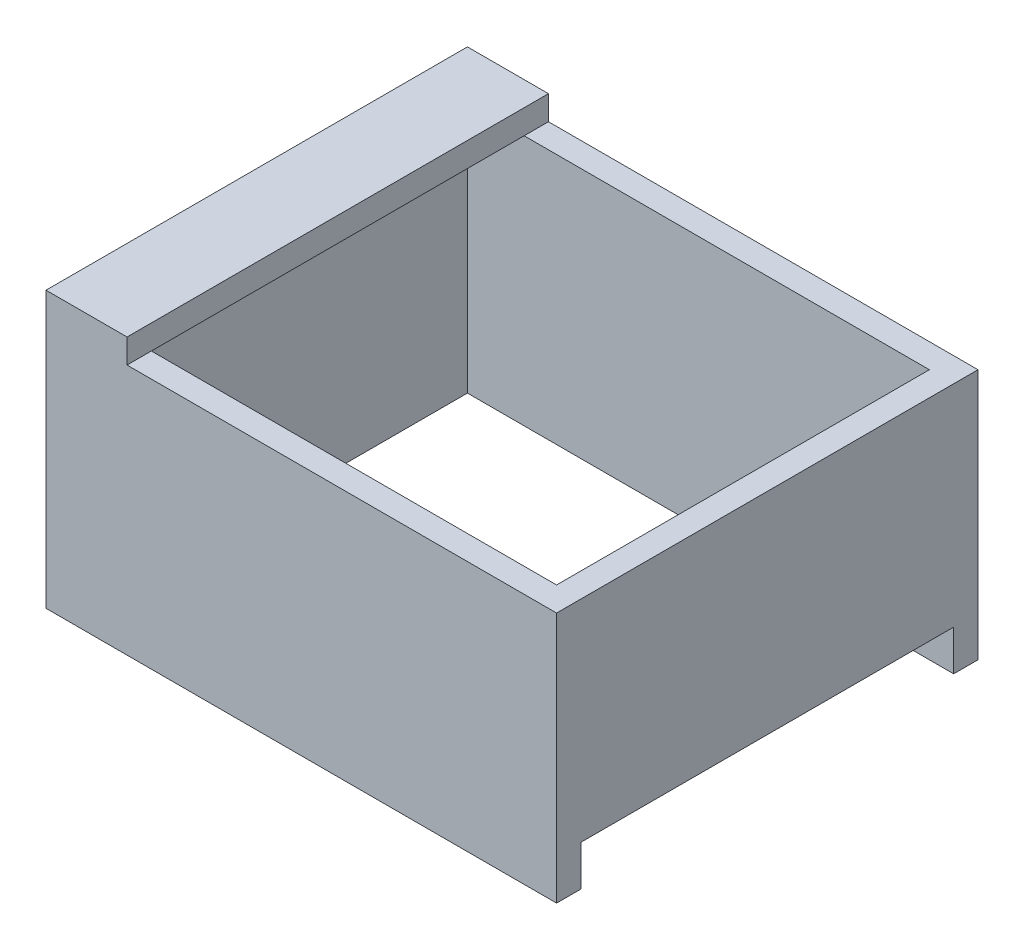
ISO-10303-21;
HEADER;
FILE_DESCRIPTION(('STEP AP214'),'2;1');
FILE_NAME('part.step','',(''),(''),'','','');
FILE_SCHEMA(('AUTOMOTIVE_DESIGN { 1 0 10303 214 1 1 1 1 }'));
ENDSEC;
DATA;
#1=APPLICATION_CONTEXT('core data for automotive mechanical design processes');
#2=APPLICATION_PROTOCOL_DEFINITION('international standard','automotive_design',2000,#1);
#3=PRODUCT_CONTEXT('',#1,'mechanical');
#4=PRODUCT('Part','Part','',(#3));
#5=PRODUCT_RELATED_PRODUCT_CATEGORY('part','',(#4));
#6=PRODUCT_DEFINITION_FORMATION('','',#4);
#7=PRODUCT_DEFINITION_CONTEXT('part definition',#1,'design');
#8=PRODUCT_DEFINITION('design','',#6,#7);
#9=PRODUCT_DEFINITION_SHAPE('','',#8);
#10=(LENGTH_UNIT() NAMED_UNIT(*) SI_UNIT(.MILLI.,.METRE.));
#11=(NAMED_UNIT(*) PLANE_ANGLE_UNIT() SI_UNIT($,.RADIAN.));
#12=(NAMED_UNIT(*) SI_UNIT($,.STERADIAN.) SOLID_ANGLE_UNIT());
#13=UNCERTAINTY_MEASURE_WITH_UNIT(LENGTH_MEASURE(1.E-05),#10,'distance_accuracy_value','');
#14=(GEOMETRIC_REPRESENTATION_CONTEXT(3) GLOBAL_UNCERTAINTY_ASSIGNED_CONTEXT((#13)) GLOBAL_UNIT_ASSIGNED_CONTEXT((#10,
#11,#12)) REPRESENTATION_CONTEXT('',''));
#15=CARTESIAN_POINT('',(0.,0.,0.));
#16=DIRECTION('',(0.,0.,1.));
#17=DIRECTION('',(1.,0.,0.));
#18=AXIS2_PLACEMENT_3D('',#15,#16,#17);
#19=CARTESIAN_POINT('',(0.,31.,0.));
#20=DIRECTION('',(1.,0.,0.));
#21=DIRECTION('',(0.,0.,-1.));
#22=AXIS2_PLACEMENT_3D('',#19,#20,#21);
#23=PLANE('',#22);
#24=DIRECTION('',(0.,1.,0.));
#25=VECTOR('',#24,1.);
#26=CARTESIAN_POINT('',(0.,8.,29.));
#27=LINE('',#26,#25);
#28=CARTESIAN_POINT('',(0.,8.,29.));
#29=VERTEX_POINT('',#28);
#30=CARTESIAN_POINT('',(0.,11.,29.));
#31=VERTEX_POINT('',#30);
#32=EDGE_CURVE('E196',#29,#31,#27,.T.);
#33=ORIENTED_EDGE('',*,*,#32,.F.);
#34=DIRECTION('',(0.,0.,1.));
#35=VECTOR('',#34,1.);
#36=CARTESIAN_POINT('',(0.,8.,29.));
#37=LINE('',#36,#35);
#38=CARTESIAN_POINT('',(0.,8.,46.));
#39=VERTEX_POINT('',#38);
#40=EDGE_CURVE('E210',#29,#39,#37,.T.);
#41=ORIENTED_EDGE('',*,*,#40,.T.);
#42=DIRECTION('',(0.,-1.,0.));
#43=VECTOR('',#42,1.);
#44=CARTESIAN_POINT('',(0.,31.,46.));
#45=LINE('',#44,#43);
#46=CARTESIAN_POINT('',(0.,0.,46.));
#47=VERTEX_POINT('',#46);
#48=EDGE_CURVE('E257',#39,#47,#45,.T.);
#49=ORIENTED_EDGE('',*,*,#48,.T.);
#50=DIRECTION('',(0.,0.,1.));
#51=VECTOR('',#50,1.);
#52=CARTESIAN_POINT('',(0.,0.,0.));
#53=LINE('',#52,#51);
#54=CARTESIAN_POINT('',(0.,0.,0.));
#55=VERTEX_POINT('',#54);
#56=EDGE_CURVE('E228',#55,#47,#53,.T.);
#57=ORIENTED_EDGE('',*,*,#56,.F.);
#58=DIRECTION('',(0.,-1.,0.));
#59=VECTOR('',#58,1.);
#60=CARTESIAN_POINT('',(0.,31.,0.));
#61=LINE('',#60,#59);
#62=CARTESIAN_POINT('',(0.,31.,0.));
#63=VERTEX_POINT('',#62);
#64=EDGE_CURVE('E242',#63,#55,#61,.T.);
#65=ORIENTED_EDGE('',*,*,#64,.F.);
#66=DIRECTION('',(0.,0.,1.));
#67=VECTOR('',#66,1.);
#68=CARTESIAN_POINT('',(0.,31.,0.));
#69=LINE('',#68,#67);
#70=CARTESIAN_POINT('',(0.,31.,46.));
#71=VERTEX_POINT('',#70);
#72=EDGE_CURVE('E231',#63,#71,#69,.T.);
#73=ORIENTED_EDGE('',*,*,#72,.T.);
#74=CARTESIAN_POINT('',(0.,11.,46.));
#75=VERTEX_POINT('',#74);
#76=EDGE_CURVE('E258',#71,#75,#45,.T.);
#77=ORIENTED_EDGE('',*,*,#76,.T.);
#78=DIRECTION('',(0.,0.,1.));
#79=VECTOR('',#78,1.);
#80=CARTESIAN_POINT('',(0.,11.,29.));
#81=LINE('',#80,#79);
#82=EDGE_CURVE('E208',#31,#75,#81,.T.);
#83=ORIENTED_EDGE('',*,*,#82,.F.);
#84=EDGE_LOOP('',(#33,#41,#49,#57,#65,#73,#77,#83));
#85=FACE_BOUND('',#84,.T.);
#86=ADVANCED_FACE('F33',(#85),#23,.T.);
#87=CARTESIAN_POINT('',(0.,31.,46.));
#88=DIRECTION('',(0.,0.,-1.));
#89=DIRECTION('',(-1.,0.,0.));
#90=AXIS2_PLACEMENT_3D('',#87,#88,#89);
#91=PLANE('',#90);
#92=ORIENTED_EDGE('',*,*,#48,.F.);
#93=DIRECTION('',(-1.,0.,0.));
#94=VECTOR('',#93,1.);
#95=CARTESIAN_POINT('',(52.,8.,46.));
#96=LINE('',#95,#94);
#97=CARTESIAN_POINT('',(52.,8.,46.));
#98=VERTEX_POINT('',#97);
#99=EDGE_CURVE('E203',#98,#39,#96,.T.);
#100=ORIENTED_EDGE('',*,*,#99,.F.);
#101=DIRECTION('',(0.,-1.,0.));
#102=VECTOR('',#101,1.);
#103=CARTESIAN_POINT('',(52.,8.,46.));
#104=LINE('',#103,#102);
#105=CARTESIAN_POINT('',(52.,11.,46.));
#106=VERTEX_POINT('',#105);
#107=EDGE_CURVE('E189',#106,#98,#104,.T.);
#108=ORIENTED_EDGE('',*,*,#107,.F.);
#109=DIRECTION('',(1.,0.,0.));
#110=VECTOR('',#109,1.);
#111=CARTESIAN_POINT('',(52.,11.,46.));
#112=LINE('',#111,#110);
#113=EDGE_CURVE('E194',#75,#106,#112,.T.);
#114=ORIENTED_EDGE('',*,*,#113,.F.);
#115=ORIENTED_EDGE('',*,*,#76,.F.);
#116=DIRECTION('',(1.,0.,0.));
#117=VECTOR('',#116,1.);
#118=CARTESIAN_POINT('',(0.,31.,46.));
#119=LINE('',#118,#117);
#120=CARTESIAN_POINT('',(7.00000000000001,31.,46.));
#121=VERTEX_POINT('',#120);
#122=EDGE_CURVE('E234',#71,#121,#119,.T.);
#123=ORIENTED_EDGE('',*,*,#122,.T.);
#124=CARTESIAN_POINT('',(57.,31.,46.));
#125=VERTEX_POINT('',#124);
#126=EDGE_CURVE('E56',#121,#125,#119,.T.);
#127=ORIENTED_EDGE('',*,*,#126,.T.);
#128=DIRECTION('',(0.,-1.,0.));
#129=VECTOR('',#128,1.);
#130=CARTESIAN_POINT('',(57.,31.,46.));
#131=LINE('',#130,#129);
#132=CARTESIAN_POINT('',(57.,5.,46.));
#133=VERTEX_POINT('',#132);
#134=EDGE_CURVE('E254',#125,#133,#131,.T.);
#135=ORIENTED_EDGE('',*,*,#134,.T.);
#136=DIRECTION('',(-1.,0.,0.));
#137=VECTOR('',#136,1.);
#138=CARTESIAN_POINT('',(57.,5.,46.));
#139=LINE('',#138,#137);
#140=CARTESIAN_POINT('',(60.,5.,46.));
#141=VERTEX_POINT('',#140);
#142=EDGE_CURVE('E222',#141,#133,#139,.T.);
#143=ORIENTED_EDGE('',*,*,#142,.F.);
#144=DIRECTION('',(0.,-1.,0.));
#145=VECTOR('',#144,1.);
#146=CARTESIAN_POINT('',(60.,5.,46.));
#147=LINE('',#146,#145);
#148=CARTESIAN_POINT('',(60.,0.,46.));
#149=VERTEX_POINT('',#148);
#150=EDGE_CURVE('E225',#141,#149,#147,.T.);
#151=ORIENTED_EDGE('',*,*,#150,.T.);
#152=DIRECTION('',(1.,0.,0.));
#153=VECTOR('',#152,1.);
#154=CARTESIAN_POINT('',(0.,0.,46.));
#155=LINE('',#154,#153);
#156=EDGE_CURVE('E245',#47,#149,#155,.T.);
#157=ORIENTED_EDGE('',*,*,#156,.F.);
#158=EDGE_LOOP('',(#92,#100,#108,#114,#115,#123,#127,#135,#143,#151,#157));
#159=FACE_BOUND('',#158,.T.);
#160=ADVANCED_FACE('F296',(#159),#91,.T.);
#161=CARTESIAN_POINT('',(57.,31.,0.));
#162=DIRECTION('',(-1.,0.,0.));
#163=DIRECTION('',(0.,0.,1.));
#164=AXIS2_PLACEMENT_3D('',#161,#162,#163);
#165=PLANE('',#164);
#166=DIRECTION('',(0.,-1.,0.));
#167=VECTOR('',#166,1.);
#168=CARTESIAN_POINT('',(57.,31.,0.));
#169=LINE('',#168,#167);
#170=CARTESIAN_POINT('',(57.,31.,0.));
#171=VERTEX_POINT('',#170);
#172=CARTESIAN_POINT('',(57.,5.,0.));
#173=VERTEX_POINT('',#172);
#174=EDGE_CURVE('E251',#171,#173,#169,.T.);
#175=ORIENTED_EDGE('',*,*,#174,.T.);
#176=DIRECTION('',(0.,0.,-1.));
#177=VECTOR('',#176,1.);
#178=CARTESIAN_POINT('',(57.,5.,46.));
#179=LINE('',#178,#177);
#180=EDGE_CURVE('E215',#133,#173,#179,.T.);
#181=ORIENTED_EDGE('',*,*,#180,.F.);
#182=ORIENTED_EDGE('',*,*,#134,.F.);
#183=DIRECTION('',(0.,0.,-1.));
#184=VECTOR('',#183,1.);
#185=CARTESIAN_POINT('',(57.,31.,0.));
#186=LINE('',#185,#184);
#187=EDGE_CURVE('E236',#125,#171,#186,.T.);
#188=ORIENTED_EDGE('',*,*,#187,.T.);
#189=EDGE_LOOP('',(#175,#181,#182,#188));
#190=FACE_BOUND('',#189,.T.);
#191=ADVANCED_FACE('F303',(#190),#165,.T.);
#192=CARTESIAN_POINT('',(0.,31.,0.));
#193=DIRECTION('',(0.,1.,0.));
#194=DIRECTION('',(0.,0.,1.));
#195=AXIS2_PLACEMENT_3D('',#192,#193,#194);
#196=PLANE('',#195);
#197=DIRECTION('',(0.,0.,-1.));
#198=VECTOR('',#197,1.);
#199=CARTESIAN_POINT('',(7.00000000000001,31.,49.));
#200=LINE('',#199,#198);
#201=CARTESIAN_POINT('',(7.00000000000001,31.,49.));
#202=VERTEX_POINT('',#201);
#203=EDGE_CURVE('E43',#202,#121,#200,.T.);
#204=ORIENTED_EDGE('',*,*,#203,.F.);
#205=DIRECTION('',(1.,0.,0.));
#206=VECTOR('',#205,1.);
#207=CARTESIAN_POINT('',(-2.99999999999999,31.,49.));
#208=LINE('',#207,#206);
#209=CARTESIAN_POINT('',(60.,31.,49.));
#210=VERTEX_POINT('',#209);
#211=EDGE_CURVE('E268',#202,#210,#208,.T.);
#212=ORIENTED_EDGE('',*,*,#211,.T.);
#213=DIRECTION('',(0.,0.,-1.));
#214=VECTOR('',#213,1.);
#215=CARTESIAN_POINT('',(60.,31.,49.));
#216=LINE('',#215,#214);
#217=CARTESIAN_POINT('',(60.,31.,-3.));
#218=VERTEX_POINT('',#217);
#219=EDGE_CURVE('E262',#210,#218,#216,.T.);
#220=ORIENTED_EDGE('',*,*,#219,.T.);
#221=DIRECTION('',(-1.,0.,0.));
#222=VECTOR('',#221,1.);
#223=CARTESIAN_POINT('',(60.,31.,-3.));
#224=LINE('',#223,#222);
#225=CARTESIAN_POINT('',(7.00000000000001,31.,-3.));
#226=VERTEX_POINT('',#225);
#227=EDGE_CURVE('E265',#218,#226,#224,.T.);
#228=ORIENTED_EDGE('',*,*,#227,.T.);
#229=CARTESIAN_POINT('',(7.,31.,0.));
#230=VERTEX_POINT('',#229);
#231=EDGE_CURVE('E11',#230,#226,#200,.T.);
#232=ORIENTED_EDGE('',*,*,#231,.F.);
#233=DIRECTION('',(-1.,0.,0.));
#234=VECTOR('',#233,1.);
#235=CARTESIAN_POINT('',(0.,31.,0.));
#236=LINE('',#235,#234);
#237=EDGE_CURVE('E240',#171,#230,#236,.T.);
#238=ORIENTED_EDGE('',*,*,#237,.F.);
#239=ORIENTED_EDGE('',*,*,#187,.F.);
#240=ORIENTED_EDGE('',*,*,#126,.F.);
#241=EDGE_LOOP('',(#204,#212,#220,#228,#232,#238,#239,#240));
#242=FACE_BOUND('',#241,.T.);
#243=ADVANCED_FACE('F334',(#242),#196,.T.);
#244=CARTESIAN_POINT('',(0.,0.,0.));
#245=DIRECTION('',(0.,1.,0.));
#246=DIRECTION('',(0.,0.,1.));
#247=AXIS2_PLACEMENT_3D('',#244,#245,#246);
#248=PLANE('',#247);
#249=ORIENTED_EDGE('',*,*,#156,.T.);
#250=DIRECTION('',(0.,0.,-1.));
#251=VECTOR('',#250,1.);
#252=CARTESIAN_POINT('',(60.,0.,49.));
#253=LINE('',#252,#251);
#254=CARTESIAN_POINT('',(60.,0.,49.));
#255=VERTEX_POINT('',#254);
#256=EDGE_CURVE('E270',#255,#149,#253,.T.);
#257=ORIENTED_EDGE('',*,*,#256,.F.);
#258=DIRECTION('',(1.,0.,0.));
#259=VECTOR('',#258,1.);
#260=CARTESIAN_POINT('',(-2.99999999999999,0.,49.));
#261=LINE('',#260,#259);
#262=CARTESIAN_POINT('',(-2.99999999999999,0.,49.));
#263=VERTEX_POINT('',#262);
#264=EDGE_CURVE('E266',#263,#255,#261,.T.);
#265=ORIENTED_EDGE('',*,*,#264,.F.);
#266=DIRECTION('',(0.,0.,1.));
#267=VECTOR('',#266,1.);
#268=CARTESIAN_POINT('',(-3.,0.,-3.));
#269=LINE('',#268,#267);
#270=CARTESIAN_POINT('',(-3.,0.,-3.));
#271=VERTEX_POINT('',#270);
#272=EDGE_CURVE('E160',#271,#263,#269,.T.);
#273=ORIENTED_EDGE('',*,*,#272,.F.);
#274=DIRECTION('',(-1.,0.,0.));
#275=VECTOR('',#274,1.);
#276=CARTESIAN_POINT('',(60.,0.,-3.));
#277=LINE('',#276,#275);
#278=CARTESIAN_POINT('',(60.,0.,-3.));
#279=VERTEX_POINT('',#278);
#280=EDGE_CURVE('E273',#279,#271,#277,.T.);
#281=ORIENTED_EDGE('',*,*,#280,.F.);
#282=CARTESIAN_POINT('',(60.,0.,0.));
#283=VERTEX_POINT('',#282);
#284=EDGE_CURVE('E261',#283,#279,#253,.T.);
#285=ORIENTED_EDGE('',*,*,#284,.F.);
#286=DIRECTION('',(-1.,0.,0.));
#287=VECTOR('',#286,1.);
#288=CARTESIAN_POINT('',(0.,0.,0.));
#289=LINE('',#288,#287);
#290=EDGE_CURVE('E233',#283,#55,#289,.T.);
#291=ORIENTED_EDGE('',*,*,#290,.T.);
#292=ORIENTED_EDGE('',*,*,#56,.T.);
#293=EDGE_LOOP('',(#249,#257,#265,#273,#281,#285,#291,#292));
#294=FACE_BOUND('',#293,.T.);
#295=ADVANCED_FACE('F288',(#294),#248,.F.);
#296=CARTESIAN_POINT('',(60.,31.,49.));
#297=DIRECTION('',(-1.,0.,0.));
#298=DIRECTION('',(0.,0.,1.));
#299=AXIS2_PLACEMENT_3D('',#296,#297,#298);
#300=PLANE('',#299);
#301=ORIENTED_EDGE('',*,*,#256,.T.);
#302=ORIENTED_EDGE('',*,*,#150,.F.);
#303=DIRECTION('',(0.,0.,1.));
#304=VECTOR('',#303,1.);
#305=CARTESIAN_POINT('',(60.,5.,46.));
#306=LINE('',#305,#304);
#307=CARTESIAN_POINT('',(60.,5.,0.));
#308=VERTEX_POINT('',#307);
#309=EDGE_CURVE('E220',#308,#141,#306,.T.);
#310=ORIENTED_EDGE('',*,*,#309,.F.);
#311=DIRECTION('',(0.,-1.,0.));
#312=VECTOR('',#311,1.);
#313=CARTESIAN_POINT('',(60.,5.,0.));
#314=LINE('',#313,#312);
#315=EDGE_CURVE('E224',#308,#283,#314,.T.);
#316=ORIENTED_EDGE('',*,*,#315,.T.);
#317=ORIENTED_EDGE('',*,*,#284,.T.);
#318=DIRECTION('',(0.,-1.,0.));
#319=VECTOR('',#318,1.);
#320=CARTESIAN_POINT('',(60.,31.,-3.));
#321=LINE('',#320,#319);
#322=EDGE_CURVE('E37',#218,#279,#321,.T.);
#323=ORIENTED_EDGE('',*,*,#322,.F.);
#324=ORIENTED_EDGE('',*,*,#219,.F.);
#325=DIRECTION('',(0.,-1.,0.));
#326=VECTOR('',#325,1.);
#327=CARTESIAN_POINT('',(60.,31.,49.));
#328=LINE('',#327,#326);
#329=EDGE_CURVE('E164',#210,#255,#328,.T.);
#330=ORIENTED_EDGE('',*,*,#329,.T.);
#331=EDGE_LOOP('',(#301,#302,#310,#316,#317,#323,#324,#330));
#332=FACE_BOUND('',#331,.T.);
#333=ADVANCED_FACE('F35',(#332),#300,.F.);
#334=CARTESIAN_POINT('',(60.,31.,-3.));
#335=DIRECTION('',(0.,0.,1.));
#336=DIRECTION('',(1.,0.,0.));
#337=AXIS2_PLACEMENT_3D('',#334,#335,#336);
#338=PLANE('',#337);
#339=ORIENTED_EDGE('',*,*,#280,.T.);
#340=DIRECTION('',(0.,-1.,0.));
#341=VECTOR('',#340,1.);
#342=CARTESIAN_POINT('',(-3.,31.,-3.));
#343=LINE('',#342,#341);
#344=CARTESIAN_POINT('',(-2.99999999999999,34.,-3.));
#345=VERTEX_POINT('',#344);
#346=EDGE_CURVE('E163',#345,#271,#343,.T.);
#347=ORIENTED_EDGE('',*,*,#346,.F.);
#348=DIRECTION('',(-1.,0.,0.));
#349=VECTOR('',#348,1.);
#350=CARTESIAN_POINT('',(-2.99999999999999,34.,-3.));
#351=LINE('',#350,#349);
#352=CARTESIAN_POINT('',(7.00000000000001,34.,-3.));
#353=VERTEX_POINT('',#352);
#354=EDGE_CURVE('E179',#353,#345,#351,.T.);
#355=ORIENTED_EDGE('',*,*,#354,.F.);
#356=DIRECTION('',(0.,-1.,0.));
#357=VECTOR('',#356,1.);
#358=CARTESIAN_POINT('',(7.00000000000001,34.,-3.));
#359=LINE('',#358,#357);
#360=EDGE_CURVE('E184',#353,#226,#359,.T.);
#361=ORIENTED_EDGE('',*,*,#360,.T.);
#362=ORIENTED_EDGE('',*,*,#227,.F.);
#363=ORIENTED_EDGE('',*,*,#322,.T.);
#364=EDGE_LOOP('',(#339,#347,#355,#361,#362,#363));
#365=FACE_BOUND('',#364,.T.);
#366=ADVANCED_FACE('F281',(#365),#338,.F.);
#367=CARTESIAN_POINT('',(-3.,31.,-3.));
#368=DIRECTION('',(1.,0.,0.));
#369=DIRECTION('',(0.,0.,-1.));
#370=AXIS2_PLACEMENT_3D('',#367,#368,#369);
#371=PLANE('',#370);
#372=ORIENTED_EDGE('',*,*,#272,.T.);
#373=DIRECTION('',(0.,-1.,0.));
#374=VECTOR('',#373,1.);
#375=CARTESIAN_POINT('',(-2.99999999999999,31.,49.));
#376=LINE('',#375,#374);
#377=CARTESIAN_POINT('',(-2.99999999999999,34.,49.));
#378=VERTEX_POINT('',#377);
#379=EDGE_CURVE('E153',#378,#263,#376,.T.);
#380=ORIENTED_EDGE('',*,*,#379,.F.);
#381=DIRECTION('',(0.,0.,1.));
#382=VECTOR('',#381,1.);
#383=CARTESIAN_POINT('',(-2.99999999999999,34.,49.));
#384=LINE('',#383,#382);
#385=EDGE_CURVE('E158',#345,#378,#384,.T.);
#386=ORIENTED_EDGE('',*,*,#385,.F.);
#387=ORIENTED_EDGE('',*,*,#346,.T.);
#388=EDGE_LOOP('',(#372,#380,#386,#387));
#389=FACE_BOUND('',#388,.T.);
#390=ADVANCED_FACE('F155',(#389),#371,.F.);
#391=CARTESIAN_POINT('',(-2.99999999999999,31.,49.));
#392=DIRECTION('',(0.,0.,-1.));
#393=DIRECTION('',(-1.,0.,0.));
#394=AXIS2_PLACEMENT_3D('',#391,#392,#393);
#395=PLANE('',#394);
#396=ORIENTED_EDGE('',*,*,#264,.T.);
#397=ORIENTED_EDGE('',*,*,#329,.F.);
#398=ORIENTED_EDGE('',*,*,#211,.F.);
#399=DIRECTION('',(0.,-1.,0.));
#400=VECTOR('',#399,1.);
#401=CARTESIAN_POINT('',(7.00000000000001,34.,49.));
#402=LINE('',#401,#400);
#403=CARTESIAN_POINT('',(7.00000000000001,34.,49.));
#404=VERTEX_POINT('',#403);
#405=EDGE_CURVE('E171',#404,#202,#402,.T.);
#406=ORIENTED_EDGE('',*,*,#405,.F.);
#407=DIRECTION('',(1.,0.,0.));
#408=VECTOR('',#407,1.);
#409=CARTESIAN_POINT('',(-2.99999999999999,34.,49.));
#410=LINE('',#409,#408);
#411=EDGE_CURVE('E167',#378,#404,#410,.T.);
#412=ORIENTED_EDGE('',*,*,#411,.F.);
#413=ORIENTED_EDGE('',*,*,#379,.T.);
#414=EDGE_LOOP('',(#396,#397,#398,#406,#412,#413));
#415=FACE_BOUND('',#414,.T.);
#416=ADVANCED_FACE('F168',(#415),#395,.F.);
#417=CARTESIAN_POINT('',(0.,31.,0.));
#418=DIRECTION('',(0.,0.,1.));
#419=DIRECTION('',(1.,0.,0.));
#420=AXIS2_PLACEMENT_3D('',#417,#418,#419);
#421=PLANE('',#420);
#422=ORIENTED_EDGE('',*,*,#290,.F.);
#423=ORIENTED_EDGE('',*,*,#315,.F.);
#424=DIRECTION('',(1.,0.,0.));
#425=VECTOR('',#424,1.);
#426=CARTESIAN_POINT('',(57.,5.,0.));
#427=LINE('',#426,#425);
#428=EDGE_CURVE('E217',#173,#308,#427,.T.);
#429=ORIENTED_EDGE('',*,*,#428,.F.);
#430=ORIENTED_EDGE('',*,*,#174,.F.);
#431=ORIENTED_EDGE('',*,*,#237,.T.);
#432=EDGE_CURVE('E239',#230,#63,#236,.T.);
#433=ORIENTED_EDGE('',*,*,#432,.T.);
#434=ORIENTED_EDGE('',*,*,#64,.T.);
#435=EDGE_LOOP('',(#422,#423,#429,#430,#431,#433,#434));
#436=FACE_BOUND('',#435,.T.);
#437=ADVANCED_FACE('F305',(#436),#421,.T.);
#438=CARTESIAN_POINT('',(0.,5.,0.));
#439=DIRECTION('',(0.,-1.,0.));
#440=DIRECTION('',(0.,0.,-1.));
#441=AXIS2_PLACEMENT_3D('',#438,#439,#440);
#442=PLANE('',#441);
#443=ORIENTED_EDGE('',*,*,#180,.T.);
#444=ORIENTED_EDGE('',*,*,#428,.T.);
#445=ORIENTED_EDGE('',*,*,#309,.T.);
#446=ORIENTED_EDGE('',*,*,#142,.T.);
#447=EDGE_LOOP('',(#443,#444,#445,#446));
#448=FACE_BOUND('',#447,.T.);
#449=ADVANCED_FACE('F300',(#448),#442,.T.);
#450=CARTESIAN_POINT('',(52.,8.,29.));
#451=DIRECTION('',(-1.,0.,0.));
#452=DIRECTION('',(0.,0.,1.));
#453=AXIS2_PLACEMENT_3D('',#450,#451,#452);
#454=PLANE('',#453);
#455=ORIENTED_EDGE('',*,*,#107,.T.);
#456=DIRECTION('',(0.,0.,1.));
#457=VECTOR('',#456,1.);
#458=CARTESIAN_POINT('',(52.,8.,29.));
#459=LINE('',#458,#457);
#460=CARTESIAN_POINT('',(52.,8.,29.));
#461=VERTEX_POINT('',#460);
#462=EDGE_CURVE('E213',#461,#98,#459,.T.);
#463=ORIENTED_EDGE('',*,*,#462,.F.);
#464=DIRECTION('',(0.,-1.,0.));
#465=VECTOR('',#464,1.);
#466=CARTESIAN_POINT('',(52.,8.,29.));
#467=LINE('',#466,#465);
#468=CARTESIAN_POINT('',(52.,11.,29.));
#469=VERTEX_POINT('',#468);
#470=EDGE_CURVE('E190',#469,#461,#467,.T.);
#471=ORIENTED_EDGE('',*,*,#470,.F.);
#472=DIRECTION('',(0.,0.,1.));
#473=VECTOR('',#472,1.);
#474=CARTESIAN_POINT('',(52.,11.,29.));
#475=LINE('',#474,#473);
#476=EDGE_CURVE('E200',#469,#106,#475,.T.);
#477=ORIENTED_EDGE('',*,*,#476,.T.);
#478=EDGE_LOOP('',(#455,#463,#471,#477));
#479=FACE_BOUND('',#478,.T.);
#480=ADVANCED_FACE('F320',(#479),#454,.F.);
#481=CARTESIAN_POINT('',(52.,8.,29.));
#482=DIRECTION('',(0.,1.,0.));
#483=DIRECTION('',(0.,0.,1.));
#484=AXIS2_PLACEMENT_3D('',#481,#482,#483);
#485=PLANE('',#484);
#486=ORIENTED_EDGE('',*,*,#99,.T.);
#487=ORIENTED_EDGE('',*,*,#40,.F.);
#488=DIRECTION('',(-1.,0.,0.));
#489=VECTOR('',#488,1.);
#490=CARTESIAN_POINT('',(52.,8.,29.));
#491=LINE('',#490,#489);
#492=EDGE_CURVE('E193',#461,#29,#491,.T.);
#493=ORIENTED_EDGE('',*,*,#492,.F.);
#494=ORIENTED_EDGE('',*,*,#462,.T.);
#495=EDGE_LOOP('',(#486,#487,#493,#494));
#496=FACE_BOUND('',#495,.T.);
#497=ADVANCED_FACE('F316',(#496),#485,.F.);
#498=CARTESIAN_POINT('',(52.,11.,29.));
#499=DIRECTION('',(0.,-1.,0.));
#500=DIRECTION('',(0.,0.,-1.));
#501=AXIS2_PLACEMENT_3D('',#498,#499,#500);
#502=PLANE('',#501);
#503=ORIENTED_EDGE('',*,*,#113,.T.);
#504=ORIENTED_EDGE('',*,*,#476,.F.);
#505=DIRECTION('',(1.,0.,0.));
#506=VECTOR('',#505,1.);
#507=CARTESIAN_POINT('',(52.,11.,29.));
#508=LINE('',#507,#506);
#509=EDGE_CURVE('E198',#31,#469,#508,.T.);
#510=ORIENTED_EDGE('',*,*,#509,.F.);
#511=ORIENTED_EDGE('',*,*,#82,.T.);
#512=EDGE_LOOP('',(#503,#504,#510,#511));
#513=FACE_BOUND('',#512,.T.);
#514=ADVANCED_FACE('F324',(#513),#502,.F.);
#515=CARTESIAN_POINT('',(0.,0.,29.));
#516=DIRECTION('',(0.,0.,1.));
#517=DIRECTION('',(1.,0.,0.));
#518=AXIS2_PLACEMENT_3D('',#515,#516,#517);
#519=PLANE('',#518);
#520=ORIENTED_EDGE('',*,*,#470,.T.);
#521=ORIENTED_EDGE('',*,*,#492,.T.);
#522=ORIENTED_EDGE('',*,*,#32,.T.);
#523=ORIENTED_EDGE('',*,*,#509,.T.);
#524=EDGE_LOOP('',(#520,#521,#522,#523));
#525=FACE_BOUND('',#524,.T.);
#526=ADVANCED_FACE('F361',(#525),#519,.F.);
#527=CARTESIAN_POINT('',(0.,31.,0.));
#528=DIRECTION('',(0.,-1.,0.));
#529=DIRECTION('',(0.,0.,-1.));
#530=AXIS2_PLACEMENT_3D('',#527,#528,#529);
#531=PLANE('',#530);
#532=ORIENTED_EDGE('',*,*,#122,.F.);
#533=ORIENTED_EDGE('',*,*,#72,.F.);
#534=ORIENTED_EDGE('',*,*,#432,.F.);
#535=EDGE_CURVE('E44',#121,#230,#200,.T.);
#536=ORIENTED_EDGE('',*,*,#535,.F.);
#537=EDGE_LOOP('',(#532,#533,#534,#536));
#538=FACE_BOUND('',#537,.T.);
#539=ADVANCED_FACE('F329',(#538),#531,.T.);
#540=CARTESIAN_POINT('',(7.00000000000001,34.,49.));
#541=DIRECTION('',(-1.,0.,0.));
#542=DIRECTION('',(0.,0.,1.));
#543=AXIS2_PLACEMENT_3D('',#540,#541,#542);
#544=PLANE('',#543);
#545=ORIENTED_EDGE('',*,*,#203,.T.);
#546=ORIENTED_EDGE('',*,*,#535,.T.);
#547=ORIENTED_EDGE('',*,*,#231,.T.);
#548=ORIENTED_EDGE('',*,*,#360,.F.);
#549=DIRECTION('',(0.,0.,-1.));
#550=VECTOR('',#549,1.);
#551=CARTESIAN_POINT('',(7.00000000000001,34.,49.));
#552=LINE('',#551,#550);
#553=EDGE_CURVE('E174',#404,#353,#552,.T.);
#554=ORIENTED_EDGE('',*,*,#553,.F.);
#555=ORIENTED_EDGE('',*,*,#405,.T.);
#556=EDGE_LOOP('',(#545,#546,#547,#548,#554,#555));
#557=FACE_BOUND('',#556,.T.);
#558=ADVANCED_FACE('F333',(#557),#544,.F.);
#559=CARTESIAN_POINT('',(0.,34.,0.));
#560=DIRECTION('',(0.,-1.,0.));
#561=DIRECTION('',(0.,0.,-1.));
#562=AXIS2_PLACEMENT_3D('',#559,#560,#561);
#563=PLANE('',#562);
#564=ORIENTED_EDGE('',*,*,#385,.T.);
#565=ORIENTED_EDGE('',*,*,#411,.T.);
#566=ORIENTED_EDGE('',*,*,#553,.T.);
#567=ORIENTED_EDGE('',*,*,#354,.T.);
#568=EDGE_LOOP('',(#564,#565,#566,#567));
#569=FACE_BOUND('',#568,.T.);
#570=ADVANCED_FACE('F177',(#569),#563,.F.);
#571=CLOSED_SHELL('',(#86,#160,#191,#243,#295,#333,#366,#390,#416,#437,#449,#480,#497,#514,#526,
#539,#558,#570));
#572=MANIFOLD_SOLID_BREP('B2',#571);
#573=ADVANCED_BREP_SHAPE_REPRESENTATION('',(#18,#572),#14);
#574=SHAPE_DEFINITION_REPRESENTATION(#9,#573);
ENDSEC;
END-ISO-10303-21;
